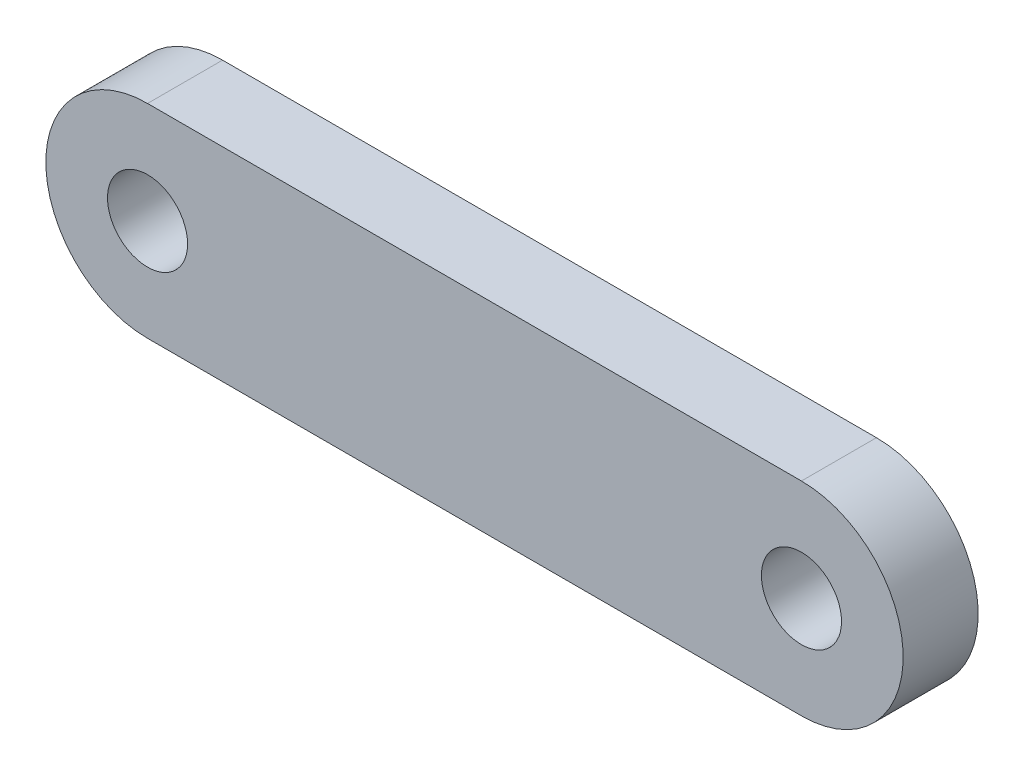
ISO-10303-21;
HEADER;
FILE_DESCRIPTION(('STEP AP214'),'2;1');
FILE_NAME('part.step','',(''),(''),'','','');
FILE_SCHEMA(('AUTOMOTIVE_DESIGN { 1 0 10303 214 1 1 1 1 }'));
ENDSEC;
DATA;
#1=APPLICATION_CONTEXT('core data for automotive mechanical design processes');
#2=APPLICATION_PROTOCOL_DEFINITION('international standard','automotive_design',2000,#1);
#3=PRODUCT_CONTEXT('',#1,'mechanical');
#4=PRODUCT('Part','Part','',(#3));
#5=PRODUCT_RELATED_PRODUCT_CATEGORY('part','',(#4));
#6=PRODUCT_DEFINITION_FORMATION('','',#4);
#7=PRODUCT_DEFINITION_CONTEXT('part definition',#1,'design');
#8=PRODUCT_DEFINITION('design','',#6,#7);
#9=PRODUCT_DEFINITION_SHAPE('','',#8);
#10=(LENGTH_UNIT() NAMED_UNIT(*) SI_UNIT(.MILLI.,.METRE.));
#11=(NAMED_UNIT(*) PLANE_ANGLE_UNIT() SI_UNIT($,.RADIAN.));
#12=(NAMED_UNIT(*) SI_UNIT($,.STERADIAN.) SOLID_ANGLE_UNIT());
#13=UNCERTAINTY_MEASURE_WITH_UNIT(LENGTH_MEASURE(1.E-05),#10,'distance_accuracy_value','');
#14=(GEOMETRIC_REPRESENTATION_CONTEXT(3) GLOBAL_UNCERTAINTY_ASSIGNED_CONTEXT((#13)) GLOBAL_UNIT_ASSIGNED_CONTEXT((#10,
#11,#12)) REPRESENTATION_CONTEXT('',''));
#15=CARTESIAN_POINT('',(0.,0.,0.));
#16=DIRECTION('',(0.,0.,1.));
#17=DIRECTION('',(1.,0.,0.));
#18=AXIS2_PLACEMENT_3D('',#15,#16,#17);
#19=CARTESIAN_POINT('',(25.7175,0.,5.9));
#20=DIRECTION('',(0.,0.,1.));
#21=DIRECTION('',(1.,0.,0.));
#22=AXIS2_PLACEMENT_3D('',#19,#20,#21);
#23=PLANE('',#22);
#24=CARTESIAN_POINT('',(25.7175,0.,5.9));
#25=DIRECTION('',(0.,0.,1.));
#26=DIRECTION('',(1.,0.,0.));
#27=AXIS2_PLACEMENT_3D('',#24,#25,#26);
#28=CIRCLE('',#27,3.15);
#29=CARTESIAN_POINT('',(28.8675,0.,5.9));
#30=VERTEX_POINT('',#29);
#31=EDGE_CURVE('E99',#30,#30,#28,.T.);
#32=ORIENTED_EDGE('',*,*,#31,.F.);
#33=EDGE_LOOP('',(#32));
#34=FACE_BOUND('',#33,.T.);
#35=CARTESIAN_POINT('',(25.7175,0.,5.9));
#36=DIRECTION('',(0.,0.,1.));
#37=DIRECTION('',(1.,0.,0.));
#38=AXIS2_PLACEMENT_3D('',#35,#36,#37);
#39=CIRCLE('',#38,8.);
#40=CARTESIAN_POINT('',(25.7175,-7.99999999999999,5.9));
#41=VERTEX_POINT('',#40);
#42=CARTESIAN_POINT('',(25.7175,8.00000000000001,5.9));
#43=VERTEX_POINT('',#42);
#44=EDGE_CURVE('E84',#41,#43,#39,.T.);
#45=ORIENTED_EDGE('',*,*,#44,.T.);
#46=DIRECTION('',(-1.,0.,0.));
#47=VECTOR('',#46,1.);
#48=CARTESIAN_POINT('',(25.7175,8.00000000000001,5.9));
#49=LINE('',#48,#47);
#50=CARTESIAN_POINT('',(-25.7175,8.,5.9));
#51=VERTEX_POINT('',#50);
#52=EDGE_CURVE('E79',#43,#51,#49,.T.);
#53=ORIENTED_EDGE('',*,*,#52,.T.);
#54=CARTESIAN_POINT('',(-25.7175,0.,5.9));
#55=DIRECTION('',(0.,0.,1.));
#56=DIRECTION('',(1.,0.,0.));
#57=AXIS2_PLACEMENT_3D('',#54,#55,#56);
#58=CIRCLE('',#57,8.);
#59=CARTESIAN_POINT('',(-25.7175,-8.00000000000001,5.9));
#60=VERTEX_POINT('',#59);
#61=EDGE_CURVE('E82',#51,#60,#58,.T.);
#62=ORIENTED_EDGE('',*,*,#61,.T.);
#63=DIRECTION('',(1.,0.,0.));
#64=VECTOR('',#63,1.);
#65=CARTESIAN_POINT('',(25.7175,-7.99999999999999,5.9));
#66=LINE('',#65,#64);
#67=EDGE_CURVE('E49',#60,#41,#66,.T.);
#68=ORIENTED_EDGE('',*,*,#67,.T.);
#69=EDGE_LOOP('',(#45,#53,#62,#68));
#70=FACE_BOUND('',#69,.T.);
#71=CARTESIAN_POINT('',(-25.7175,0.,5.9));
#72=DIRECTION('',(0.,0.,1.));
#73=DIRECTION('',(1.,0.,0.));
#74=AXIS2_PLACEMENT_3D('',#71,#72,#73);
#75=CIRCLE('',#74,3.15);
#76=CARTESIAN_POINT('',(-22.5675,0.,5.9));
#77=VERTEX_POINT('',#76);
#78=EDGE_CURVE('E114',#77,#77,#75,.T.);
#79=ORIENTED_EDGE('',*,*,#78,.F.);
#80=EDGE_LOOP('',(#79));
#81=FACE_BOUND('',#80,.T.);
#82=ADVANCED_FACE('F32',(#34,#70,#81),#23,.T.);
#83=CARTESIAN_POINT('',(25.7175,0.,0.));
#84=DIRECTION('',(0.,0.,1.));
#85=DIRECTION('',(1.,0.,0.));
#86=AXIS2_PLACEMENT_3D('',#83,#84,#85);
#87=PLANE('',#86);
#88=CARTESIAN_POINT('',(25.7175,0.,0.));
#89=DIRECTION('',(0.,0.,1.));
#90=DIRECTION('',(1.,0.,0.));
#91=AXIS2_PLACEMENT_3D('',#88,#89,#90);
#92=CIRCLE('',#91,8.);
#93=CARTESIAN_POINT('',(25.7175,-7.99999999999999,0.));
#94=VERTEX_POINT('',#93);
#95=CARTESIAN_POINT('',(25.7175,8.00000000000001,0.));
#96=VERTEX_POINT('',#95);
#97=EDGE_CURVE('E96',#94,#96,#92,.T.);
#98=ORIENTED_EDGE('',*,*,#97,.F.);
#99=DIRECTION('',(1.,0.,0.));
#100=VECTOR('',#99,1.);
#101=CARTESIAN_POINT('',(25.7175,-7.99999999999999,0.));
#102=LINE('',#101,#100);
#103=CARTESIAN_POINT('',(-25.7175,-8.00000000000001,0.));
#104=VERTEX_POINT('',#103);
#105=EDGE_CURVE('E72',#104,#94,#102,.T.);
#106=ORIENTED_EDGE('',*,*,#105,.F.);
#107=CARTESIAN_POINT('',(-25.7175,0.,0.));
#108=DIRECTION('',(0.,0.,1.));
#109=DIRECTION('',(1.,0.,0.));
#110=AXIS2_PLACEMENT_3D('',#107,#108,#109);
#111=CIRCLE('',#110,8.);
#112=CARTESIAN_POINT('',(-25.7175,8.,0.));
#113=VERTEX_POINT('',#112);
#114=EDGE_CURVE('E66',#113,#104,#111,.T.);
#115=ORIENTED_EDGE('',*,*,#114,.F.);
#116=DIRECTION('',(-1.,0.,0.));
#117=VECTOR('',#116,1.);
#118=CARTESIAN_POINT('',(25.7175,8.00000000000001,0.));
#119=LINE('',#118,#117);
#120=EDGE_CURVE('E88',#96,#113,#119,.T.);
#121=ORIENTED_EDGE('',*,*,#120,.F.);
#122=EDGE_LOOP('',(#98,#106,#115,#121));
#123=FACE_BOUND('',#122,.T.);
#124=CARTESIAN_POINT('',(25.7175,0.,0.));
#125=DIRECTION('',(0.,0.,1.));
#126=DIRECTION('',(1.,0.,0.));
#127=AXIS2_PLACEMENT_3D('',#124,#125,#126);
#128=CIRCLE('',#127,3.15);
#129=CARTESIAN_POINT('',(28.8675,0.,0.));
#130=VERTEX_POINT('',#129);
#131=EDGE_CURVE('E111',#130,#130,#128,.T.);
#132=ORIENTED_EDGE('',*,*,#131,.T.);
#133=EDGE_LOOP('',(#132));
#134=FACE_BOUND('',#133,.T.);
#135=CARTESIAN_POINT('',(-25.7175,0.,0.));
#136=DIRECTION('',(0.,0.,1.));
#137=DIRECTION('',(1.,0.,0.));
#138=AXIS2_PLACEMENT_3D('',#135,#136,#137);
#139=CIRCLE('',#138,3.15);
#140=CARTESIAN_POINT('',(-22.5675,0.,0.));
#141=VERTEX_POINT('',#140);
#142=EDGE_CURVE('E117',#141,#141,#139,.T.);
#143=ORIENTED_EDGE('',*,*,#142,.T.);
#144=EDGE_LOOP('',(#143));
#145=FACE_BOUND('',#144,.T.);
#146=ADVANCED_FACE('F107',(#123,#134,#145),#87,.F.);
#147=CARTESIAN_POINT('',(25.7175,0.,5.9));
#148=DIRECTION('',(0.,0.,-1.));
#149=DIRECTION('',(-1.,0.,0.));
#150=AXIS2_PLACEMENT_3D('',#147,#148,#149);
#151=CYLINDRICAL_SURFACE('',#150,8.);
#152=ORIENTED_EDGE('',*,*,#97,.T.);
#153=DIRECTION('',(0.,0.,-1.));
#154=VECTOR('',#153,1.);
#155=CARTESIAN_POINT('',(25.7175,8.00000000000001,5.9));
#156=LINE('',#155,#154);
#157=EDGE_CURVE('E11',#43,#96,#156,.T.);
#158=ORIENTED_EDGE('',*,*,#157,.F.);
#159=ORIENTED_EDGE('',*,*,#44,.F.);
#160=DIRECTION('',(0.,0.,-1.));
#161=VECTOR('',#160,1.);
#162=CARTESIAN_POINT('',(25.7175,-7.99999999999999,5.9));
#163=LINE('',#162,#161);
#164=EDGE_CURVE('E92',#41,#94,#163,.T.);
#165=ORIENTED_EDGE('',*,*,#164,.T.);
#166=EDGE_LOOP('',(#152,#158,#159,#165));
#167=FACE_BOUND('',#166,.T.);
#168=ADVANCED_FACE('F34',(#167),#151,.T.);
#169=CARTESIAN_POINT('',(25.7175,8.00000000000001,5.9));
#170=DIRECTION('',(0.,-1.,0.));
#171=DIRECTION('',(1.,0.,0.));
#172=AXIS2_PLACEMENT_3D('',#169,#170,#171);
#173=PLANE('',#172);
#174=ORIENTED_EDGE('',*,*,#120,.T.);
#175=DIRECTION('',(0.,0.,-1.));
#176=VECTOR('',#175,1.);
#177=CARTESIAN_POINT('',(-25.7175,8.,5.9));
#178=LINE('',#177,#176);
#179=EDGE_CURVE('E41',#51,#113,#178,.T.);
#180=ORIENTED_EDGE('',*,*,#179,.F.);
#181=ORIENTED_EDGE('',*,*,#52,.F.);
#182=ORIENTED_EDGE('',*,*,#157,.T.);
#183=EDGE_LOOP('',(#174,#180,#181,#182));
#184=FACE_BOUND('',#183,.T.);
#185=ADVANCED_FACE('F87',(#184),#173,.F.);
#186=CARTESIAN_POINT('',(-25.7175,0.,5.9));
#187=DIRECTION('',(0.,0.,-1.));
#188=DIRECTION('',(-1.,0.,0.));
#189=AXIS2_PLACEMENT_3D('',#186,#187,#188);
#190=CYLINDRICAL_SURFACE('',#189,8.);
#191=ORIENTED_EDGE('',*,*,#114,.T.);
#192=DIRECTION('',(0.,0.,-1.));
#193=VECTOR('',#192,1.);
#194=CARTESIAN_POINT('',(-25.7175,-8.00000000000001,5.9));
#195=LINE('',#194,#193);
#196=EDGE_CURVE('E89',#60,#104,#195,.T.);
#197=ORIENTED_EDGE('',*,*,#196,.F.);
#198=ORIENTED_EDGE('',*,*,#61,.F.);
#199=ORIENTED_EDGE('',*,*,#179,.T.);
#200=EDGE_LOOP('',(#191,#197,#198,#199));
#201=FACE_BOUND('',#200,.T.);
#202=ADVANCED_FACE('F90',(#201),#190,.T.);
#203=CARTESIAN_POINT('',(25.7175,-7.99999999999999,5.9));
#204=DIRECTION('',(0.,1.,0.));
#205=DIRECTION('',(-1.,0.,0.));
#206=AXIS2_PLACEMENT_3D('',#203,#204,#205);
#207=PLANE('',#206);
#208=ORIENTED_EDGE('',*,*,#105,.T.);
#209=ORIENTED_EDGE('',*,*,#164,.F.);
#210=ORIENTED_EDGE('',*,*,#67,.F.);
#211=ORIENTED_EDGE('',*,*,#196,.T.);
#212=EDGE_LOOP('',(#208,#209,#210,#211));
#213=FACE_BOUND('',#212,.T.);
#214=ADVANCED_FACE('F104',(#213),#207,.F.);
#215=CARTESIAN_POINT('',(25.7175,0.,5.9));
#216=DIRECTION('',(0.,0.,-1.));
#217=DIRECTION('',(-1.,0.,0.));
#218=AXIS2_PLACEMENT_3D('',#215,#216,#217);
#219=CYLINDRICAL_SURFACE('',#218,3.15);
#220=ORIENTED_EDGE('',*,*,#31,.T.);
#221=EDGE_LOOP('',(#220));
#222=FACE_BOUND('',#221,.T.);
#223=ORIENTED_EDGE('',*,*,#131,.F.);
#224=EDGE_LOOP('',(#223));
#225=FACE_BOUND('',#224,.T.);
#226=ADVANCED_FACE('F134',(#222,#225),#219,.F.);
#227=CARTESIAN_POINT('',(-25.7175,0.,5.9));
#228=DIRECTION('',(0.,0.,-1.));
#229=DIRECTION('',(-1.,0.,0.));
#230=AXIS2_PLACEMENT_3D('',#227,#228,#229);
#231=CYLINDRICAL_SURFACE('',#230,3.15);
#232=ORIENTED_EDGE('',*,*,#78,.T.);
#233=EDGE_LOOP('',(#232));
#234=FACE_BOUND('',#233,.T.);
#235=ORIENTED_EDGE('',*,*,#142,.F.);
#236=EDGE_LOOP('',(#235));
#237=FACE_BOUND('',#236,.T.);
#238=ADVANCED_FACE('F123',(#234,#237),#231,.F.);
#239=CLOSED_SHELL('',(#82,#146,#168,#185,#202,#214,#226,#238));
#240=MANIFOLD_SOLID_BREP('B2',#239);
#241=ADVANCED_BREP_SHAPE_REPRESENTATION('',(#18,#240),#14);
#242=SHAPE_DEFINITION_REPRESENTATION(#9,#241);
ENDSEC;
END-ISO-10303-21;
